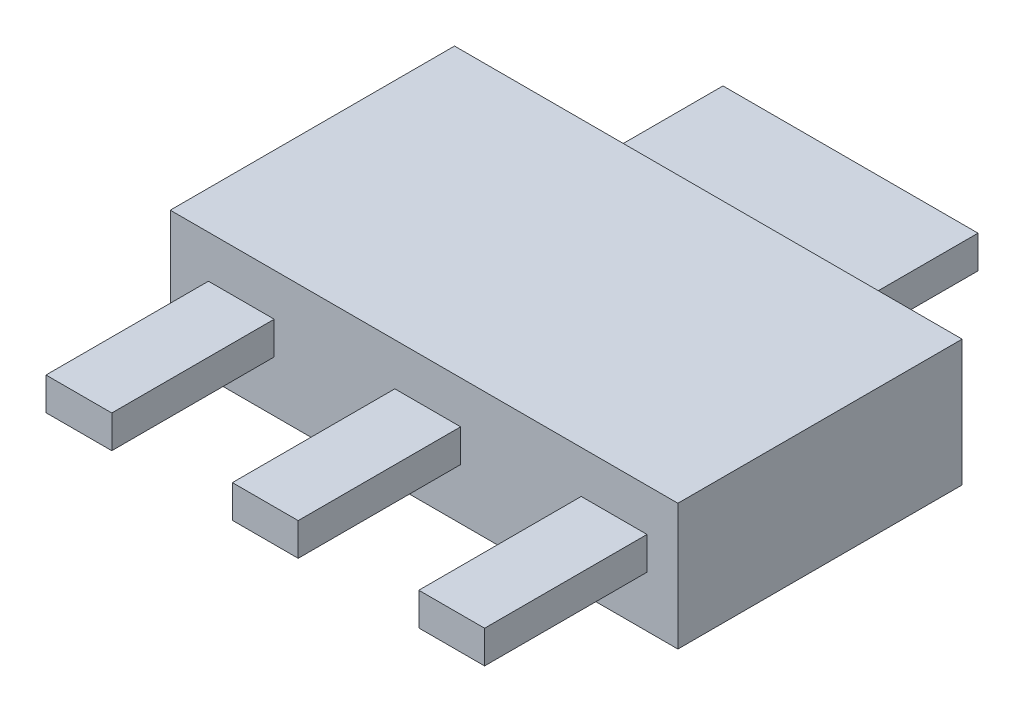
ISO-10303-21;
HEADER;
FILE_DESCRIPTION(('STEP AP214'),'2;1');
FILE_NAME('part.step','',(''),(''),'','','');
FILE_SCHEMA(('AUTOMOTIVE_DESIGN { 1 0 10303 214 1 1 1 1 }'));
ENDSEC;
DATA;
#1=APPLICATION_CONTEXT('core data for automotive mechanical design processes');
#2=APPLICATION_PROTOCOL_DEFINITION('international standard','automotive_design',2000,#1);
#3=PRODUCT_CONTEXT('',#1,'mechanical');
#4=PRODUCT('Part','Part','',(#3));
#5=PRODUCT_RELATED_PRODUCT_CATEGORY('part','',(#4));
#6=PRODUCT_DEFINITION_FORMATION('','',#4);
#7=PRODUCT_DEFINITION_CONTEXT('part definition',#1,'design');
#8=PRODUCT_DEFINITION('design','',#6,#7);
#9=PRODUCT_DEFINITION_SHAPE('','',#8);
#10=(LENGTH_UNIT() NAMED_UNIT(*) SI_UNIT(.MILLI.,.METRE.));
#11=(NAMED_UNIT(*) PLANE_ANGLE_UNIT() SI_UNIT($,.RADIAN.));
#12=(NAMED_UNIT(*) SI_UNIT($,.STERADIAN.) SOLID_ANGLE_UNIT());
#13=UNCERTAINTY_MEASURE_WITH_UNIT(LENGTH_MEASURE(1.E-05),#10,'distance_accuracy_value','');
#14=(GEOMETRIC_REPRESENTATION_CONTEXT(3) GLOBAL_UNCERTAINTY_ASSIGNED_CONTEXT((#13)) GLOBAL_UNIT_ASSIGNED_CONTEXT((#10,
#11,#12)) REPRESENTATION_CONTEXT('',''));
#15=CARTESIAN_POINT('',(0.,0.,0.));
#16=DIRECTION('',(0.,0.,1.));
#17=DIRECTION('',(1.,0.,0.));
#18=AXIS2_PLACEMENT_3D('',#15,#16,#17);
#19=CARTESIAN_POINT('',(5.06,1.0325,2.));
#20=DIRECTION('',(1.,0.,0.));
#21=DIRECTION('',(0.,0.,-1.));
#22=AXIS2_PLACEMENT_3D('',#19,#20,#21);
#23=PLANE('',#22);
#24=DIRECTION('',(0.,-1.,0.));
#25=VECTOR('',#24,1.);
#26=CARTESIAN_POINT('',(5.06,1.0325,0.));
#27=LINE('',#26,#25);
#28=CARTESIAN_POINT('',(5.06,1.0325,0.));
#29=VERTEX_POINT('',#28);
#30=CARTESIAN_POINT('',(5.06,0.63,0.));
#31=VERTEX_POINT('',#30);
#32=EDGE_CURVE('E106',#29,#31,#27,.T.);
#33=ORIENTED_EDGE('',*,*,#32,.T.);
#34=DIRECTION('',(0.,0.,-1.));
#35=VECTOR('',#34,1.);
#36=CARTESIAN_POINT('',(5.06,0.63,2.));
#37=LINE('',#36,#35);
#38=CARTESIAN_POINT('',(5.06,0.63,2.));
#39=VERTEX_POINT('',#38);
#40=EDGE_CURVE('E12',#39,#31,#37,.T.);
#41=ORIENTED_EDGE('',*,*,#40,.F.);
#42=DIRECTION('',(0.,-1.,0.));
#43=VECTOR('',#42,1.);
#44=CARTESIAN_POINT('',(5.06,1.0325,2.));
#45=LINE('',#44,#43);
#46=CARTESIAN_POINT('',(5.06,1.0325,2.));
#47=VERTEX_POINT('',#46);
#48=EDGE_CURVE('E94',#47,#39,#45,.T.);
#49=ORIENTED_EDGE('',*,*,#48,.F.);
#50=DIRECTION('',(0.,0.,-1.));
#51=VECTOR('',#50,1.);
#52=CARTESIAN_POINT('',(5.06,1.0325,2.));
#53=LINE('',#52,#51);
#54=EDGE_CURVE('E102',#47,#29,#53,.T.);
#55=ORIENTED_EDGE('',*,*,#54,.T.);
#56=EDGE_LOOP('',(#33,#41,#49,#55));
#57=FACE_BOUND('',#56,.T.);
#58=ADVANCED_FACE('F43',(#57),#23,.F.);
#59=CARTESIAN_POINT('',(5.06,0.63,2.));
#60=DIRECTION('',(0.,1.,0.));
#61=DIRECTION('',(0.,0.,1.));
#62=AXIS2_PLACEMENT_3D('',#59,#60,#61);
#63=PLANE('',#62);
#64=DIRECTION('',(1.,0.,0.));
#65=VECTOR('',#64,1.);
#66=CARTESIAN_POINT('',(5.06,0.63,0.));
#67=LINE('',#66,#65);
#68=CARTESIAN_POINT('',(5.87,0.63,0.));
#69=VERTEX_POINT('',#68);
#70=EDGE_CURVE('E98',#31,#69,#67,.T.);
#71=ORIENTED_EDGE('',*,*,#70,.T.);
#72=DIRECTION('',(0.,0.,-1.));
#73=VECTOR('',#72,1.);
#74=CARTESIAN_POINT('',(5.87,0.63,2.));
#75=LINE('',#74,#73);
#76=CARTESIAN_POINT('',(5.87,0.63,2.));
#77=VERTEX_POINT('',#76);
#78=EDGE_CURVE('E51',#77,#69,#75,.T.);
#79=ORIENTED_EDGE('',*,*,#78,.F.);
#80=DIRECTION('',(1.,0.,0.));
#81=VECTOR('',#80,1.);
#82=CARTESIAN_POINT('',(5.06,0.63,2.));
#83=LINE('',#82,#81);
#84=EDGE_CURVE('E89',#39,#77,#83,.T.);
#85=ORIENTED_EDGE('',*,*,#84,.F.);
#86=ORIENTED_EDGE('',*,*,#40,.T.);
#87=EDGE_LOOP('',(#71,#79,#85,#86));
#88=FACE_BOUND('',#87,.T.);
#89=ADVANCED_FACE('F97',(#88),#63,.F.);
#90=CARTESIAN_POINT('',(5.87,1.0325,2.));
#91=DIRECTION('',(-1.,0.,0.));
#92=DIRECTION('',(0.,0.,1.));
#93=AXIS2_PLACEMENT_3D('',#90,#91,#92);
#94=PLANE('',#93);
#95=DIRECTION('',(0.,1.,0.));
#96=VECTOR('',#95,1.);
#97=CARTESIAN_POINT('',(5.87,1.0325,0.));
#98=LINE('',#97,#96);
#99=CARTESIAN_POINT('',(5.87,1.0325,0.));
#100=VERTEX_POINT('',#99);
#101=EDGE_CURVE('E76',#69,#100,#98,.T.);
#102=ORIENTED_EDGE('',*,*,#101,.T.);
#103=DIRECTION('',(0.,0.,-1.));
#104=VECTOR('',#103,1.);
#105=CARTESIAN_POINT('',(5.87,1.0325,2.));
#106=LINE('',#105,#104);
#107=CARTESIAN_POINT('',(5.87,1.0325,2.));
#108=VERTEX_POINT('',#107);
#109=EDGE_CURVE('E99',#108,#100,#106,.T.);
#110=ORIENTED_EDGE('',*,*,#109,.F.);
#111=DIRECTION('',(0.,1.,0.));
#112=VECTOR('',#111,1.);
#113=CARTESIAN_POINT('',(5.87,1.0325,2.));
#114=LINE('',#113,#112);
#115=EDGE_CURVE('E92',#77,#108,#114,.T.);
#116=ORIENTED_EDGE('',*,*,#115,.F.);
#117=ORIENTED_EDGE('',*,*,#78,.T.);
#118=EDGE_LOOP('',(#102,#110,#116,#117));
#119=FACE_BOUND('',#118,.T.);
#120=ADVANCED_FACE('F100',(#119),#94,.F.);
#121=CARTESIAN_POINT('',(5.06,1.0325,2.));
#122=DIRECTION('',(0.,-1.,0.));
#123=DIRECTION('',(0.,0.,-1.));
#124=AXIS2_PLACEMENT_3D('',#121,#122,#123);
#125=PLANE('',#124);
#126=DIRECTION('',(-1.,0.,0.));
#127=VECTOR('',#126,1.);
#128=CARTESIAN_POINT('',(5.06,1.0325,0.));
#129=LINE('',#128,#127);
#130=EDGE_CURVE('E82',#100,#29,#129,.T.);
#131=ORIENTED_EDGE('',*,*,#130,.T.);
#132=ORIENTED_EDGE('',*,*,#54,.F.);
#133=DIRECTION('',(-1.,0.,0.));
#134=VECTOR('',#133,1.);
#135=CARTESIAN_POINT('',(5.06,1.0325,2.));
#136=LINE('',#135,#134);
#137=EDGE_CURVE('E59',#108,#47,#136,.T.);
#138=ORIENTED_EDGE('',*,*,#137,.F.);
#139=ORIENTED_EDGE('',*,*,#109,.T.);
#140=EDGE_LOOP('',(#131,#132,#138,#139));
#141=FACE_BOUND('',#140,.T.);
#142=ADVANCED_FACE('F113',(#141),#125,.F.);
#143=CARTESIAN_POINT('',(0.,0.,2.));
#144=DIRECTION('',(0.,0.,1.));
#145=DIRECTION('',(1.,0.,0.));
#146=AXIS2_PLACEMENT_3D('',#143,#144,#145);
#147=PLANE('',#146);
#148=ORIENTED_EDGE('',*,*,#48,.T.);
#149=ORIENTED_EDGE('',*,*,#84,.T.);
#150=ORIENTED_EDGE('',*,*,#115,.T.);
#151=ORIENTED_EDGE('',*,*,#137,.T.);
#152=EDGE_LOOP('',(#148,#149,#150,#151));
#153=FACE_BOUND('',#152,.T.);
#154=ADVANCED_FACE('F90',(#153),#147,.T.);
#155=CARTESIAN_POINT('',(0.,0.,0.));
#156=DIRECTION('',(0.,0.,1.));
#157=DIRECTION('',(1.,0.,0.));
#158=AXIS2_PLACEMENT_3D('',#155,#156,#157);
#159=PLANE('',#158);
#160=ORIENTED_EDGE('',*,*,#32,.F.);
#161=ORIENTED_EDGE('',*,*,#130,.F.);
#162=ORIENTED_EDGE('',*,*,#101,.F.);
#163=ORIENTED_EDGE('',*,*,#70,.F.);
#164=EDGE_LOOP('',(#160,#161,#162,#163));
#165=FACE_BOUND('',#164,.T.);
#166=ADVANCED_FACE('F116',(#165),#159,.F.);
#167=CLOSED_SHELL('',(#58,#89,#120,#142,#154,#166));
#168=MANIFOLD_SOLID_BREP('B2',#167);
#169=CARTESIAN_POINT('',(2.765,1.0325,2.));
#170=DIRECTION('',(1.,0.,0.));
#171=DIRECTION('',(0.,0.,-1.));
#172=AXIS2_PLACEMENT_3D('',#169,#170,#171);
#173=PLANE('',#172);
#174=DIRECTION('',(0.,-1.,0.));
#175=VECTOR('',#174,1.);
#176=CARTESIAN_POINT('',(2.765,1.0325,0.));
#177=LINE('',#176,#175);
#178=CARTESIAN_POINT('',(2.765,1.0325,0.));
#179=VERTEX_POINT('',#178);
#180=CARTESIAN_POINT('',(2.765,0.63,0.));
#181=VERTEX_POINT('',#180);
#182=EDGE_CURVE('E239',#179,#181,#177,.T.);
#183=ORIENTED_EDGE('',*,*,#182,.T.);
#184=DIRECTION('',(0.,0.,-1.));
#185=VECTOR('',#184,1.);
#186=CARTESIAN_POINT('',(2.765,0.63,2.));
#187=LINE('',#186,#185);
#188=CARTESIAN_POINT('',(2.765,0.63,2.));
#189=VERTEX_POINT('',#188);
#190=EDGE_CURVE('E41',#189,#181,#187,.T.);
#191=ORIENTED_EDGE('',*,*,#190,.F.);
#192=DIRECTION('',(0.,-1.,0.));
#193=VECTOR('',#192,1.);
#194=CARTESIAN_POINT('',(2.765,1.0325,2.));
#195=LINE('',#194,#193);
#196=CARTESIAN_POINT('',(2.765,1.0325,2.));
#197=VERTEX_POINT('',#196);
#198=EDGE_CURVE('E227',#197,#189,#195,.T.);
#199=ORIENTED_EDGE('',*,*,#198,.F.);
#200=DIRECTION('',(0.,0.,-1.));
#201=VECTOR('',#200,1.);
#202=CARTESIAN_POINT('',(2.765,1.0325,2.));
#203=LINE('',#202,#201);
#204=EDGE_CURVE('E235',#197,#179,#203,.T.);
#205=ORIENTED_EDGE('',*,*,#204,.T.);
#206=EDGE_LOOP('',(#183,#191,#199,#205));
#207=FACE_BOUND('',#206,.T.);
#208=ADVANCED_FACE('F176',(#207),#173,.F.);
#209=CARTESIAN_POINT('',(2.765,0.63,2.));
#210=DIRECTION('',(0.,1.,0.));
#211=DIRECTION('',(0.,0.,1.));
#212=AXIS2_PLACEMENT_3D('',#209,#210,#211);
#213=PLANE('',#212);
#214=DIRECTION('',(1.,0.,0.));
#215=VECTOR('',#214,1.);
#216=CARTESIAN_POINT('',(2.765,0.63,0.));
#217=LINE('',#216,#215);
#218=CARTESIAN_POINT('',(3.575,0.63,0.));
#219=VERTEX_POINT('',#218);
#220=EDGE_CURVE('E231',#181,#219,#217,.T.);
#221=ORIENTED_EDGE('',*,*,#220,.T.);
#222=DIRECTION('',(0.,0.,-1.));
#223=VECTOR('',#222,1.);
#224=CARTESIAN_POINT('',(3.575,0.63,2.));
#225=LINE('',#224,#223);
#226=CARTESIAN_POINT('',(3.575,0.63,2.));
#227=VERTEX_POINT('',#226);
#228=EDGE_CURVE('E184',#227,#219,#225,.T.);
#229=ORIENTED_EDGE('',*,*,#228,.F.);
#230=DIRECTION('',(1.,0.,0.));
#231=VECTOR('',#230,1.);
#232=CARTESIAN_POINT('',(2.765,0.63,2.));
#233=LINE('',#232,#231);
#234=EDGE_CURVE('E222',#189,#227,#233,.T.);
#235=ORIENTED_EDGE('',*,*,#234,.F.);
#236=ORIENTED_EDGE('',*,*,#190,.T.);
#237=EDGE_LOOP('',(#221,#229,#235,#236));
#238=FACE_BOUND('',#237,.T.);
#239=ADVANCED_FACE('F230',(#238),#213,.F.);
#240=CARTESIAN_POINT('',(3.575,1.0325,2.));
#241=DIRECTION('',(-1.,0.,0.));
#242=DIRECTION('',(0.,0.,1.));
#243=AXIS2_PLACEMENT_3D('',#240,#241,#242);
#244=PLANE('',#243);
#245=DIRECTION('',(0.,1.,0.));
#246=VECTOR('',#245,1.);
#247=CARTESIAN_POINT('',(3.575,1.0325,0.));
#248=LINE('',#247,#246);
#249=CARTESIAN_POINT('',(3.575,1.0325,0.));
#250=VERTEX_POINT('',#249);
#251=EDGE_CURVE('E209',#219,#250,#248,.T.);
#252=ORIENTED_EDGE('',*,*,#251,.T.);
#253=DIRECTION('',(0.,0.,-1.));
#254=VECTOR('',#253,1.);
#255=CARTESIAN_POINT('',(3.575,1.0325,2.));
#256=LINE('',#255,#254);
#257=CARTESIAN_POINT('',(3.575,1.0325,2.));
#258=VERTEX_POINT('',#257);
#259=EDGE_CURVE('E232',#258,#250,#256,.T.);
#260=ORIENTED_EDGE('',*,*,#259,.F.);
#261=DIRECTION('',(0.,1.,0.));
#262=VECTOR('',#261,1.);
#263=CARTESIAN_POINT('',(3.575,1.0325,2.));
#264=LINE('',#263,#262);
#265=EDGE_CURVE('E225',#227,#258,#264,.T.);
#266=ORIENTED_EDGE('',*,*,#265,.F.);
#267=ORIENTED_EDGE('',*,*,#228,.T.);
#268=EDGE_LOOP('',(#252,#260,#266,#267));
#269=FACE_BOUND('',#268,.T.);
#270=ADVANCED_FACE('F233',(#269),#244,.F.);
#271=CARTESIAN_POINT('',(2.765,1.0325,2.));
#272=DIRECTION('',(0.,-1.,0.));
#273=DIRECTION('',(0.,0.,-1.));
#274=AXIS2_PLACEMENT_3D('',#271,#272,#273);
#275=PLANE('',#274);
#276=DIRECTION('',(-1.,0.,0.));
#277=VECTOR('',#276,1.);
#278=CARTESIAN_POINT('',(2.765,1.0325,0.));
#279=LINE('',#278,#277);
#280=EDGE_CURVE('E215',#250,#179,#279,.T.);
#281=ORIENTED_EDGE('',*,*,#280,.T.);
#282=ORIENTED_EDGE('',*,*,#204,.F.);
#283=DIRECTION('',(-1.,0.,0.));
#284=VECTOR('',#283,1.);
#285=CARTESIAN_POINT('',(2.765,1.0325,2.));
#286=LINE('',#285,#284);
#287=EDGE_CURVE('E192',#258,#197,#286,.T.);
#288=ORIENTED_EDGE('',*,*,#287,.F.);
#289=ORIENTED_EDGE('',*,*,#259,.T.);
#290=EDGE_LOOP('',(#281,#282,#288,#289));
#291=FACE_BOUND('',#290,.T.);
#292=ADVANCED_FACE('F246',(#291),#275,.F.);
#293=CARTESIAN_POINT('',(0.,0.,2.));
#294=DIRECTION('',(0.,0.,1.));
#295=DIRECTION('',(1.,0.,0.));
#296=AXIS2_PLACEMENT_3D('',#293,#294,#295);
#297=PLANE('',#296);
#298=ORIENTED_EDGE('',*,*,#198,.T.);
#299=ORIENTED_EDGE('',*,*,#234,.T.);
#300=ORIENTED_EDGE('',*,*,#265,.T.);
#301=ORIENTED_EDGE('',*,*,#287,.T.);
#302=EDGE_LOOP('',(#298,#299,#300,#301));
#303=FACE_BOUND('',#302,.T.);
#304=ADVANCED_FACE('F223',(#303),#297,.T.);
#305=CARTESIAN_POINT('',(0.,0.,0.));
#306=DIRECTION('',(0.,0.,1.));
#307=DIRECTION('',(1.,0.,0.));
#308=AXIS2_PLACEMENT_3D('',#305,#306,#307);
#309=PLANE('',#308);
#310=ORIENTED_EDGE('',*,*,#182,.F.);
#311=ORIENTED_EDGE('',*,*,#280,.F.);
#312=ORIENTED_EDGE('',*,*,#251,.F.);
#313=ORIENTED_EDGE('',*,*,#220,.F.);
#314=EDGE_LOOP('',(#310,#311,#312,#313));
#315=FACE_BOUND('',#314,.T.);
#316=ADVANCED_FACE('F249',(#315),#309,.F.);
#317=CLOSED_SHELL('',(#208,#239,#270,#292,#304,#316));
#318=MANIFOLD_SOLID_BREP('B6',#317);
#319=CARTESIAN_POINT('',(0.47,1.0325,2.));
#320=DIRECTION('',(1.,0.,0.));
#321=DIRECTION('',(0.,0.,-1.));
#322=AXIS2_PLACEMENT_3D('',#319,#320,#321);
#323=PLANE('',#322);
#324=DIRECTION('',(0.,-1.,0.));
#325=VECTOR('',#324,1.);
#326=CARTESIAN_POINT('',(0.47,1.0325,0.));
#327=LINE('',#326,#325);
#328=CARTESIAN_POINT('',(0.47,1.0325,0.));
#329=VERTEX_POINT('',#328);
#330=CARTESIAN_POINT('',(0.47,0.63,0.));
#331=VERTEX_POINT('',#330);
#332=EDGE_CURVE('E371',#329,#331,#327,.T.);
#333=ORIENTED_EDGE('',*,*,#332,.T.);
#334=DIRECTION('',(0.,0.,-1.));
#335=VECTOR('',#334,1.);
#336=CARTESIAN_POINT('',(0.47,0.63,2.));
#337=LINE('',#336,#335);
#338=CARTESIAN_POINT('',(0.47,0.63,2.));
#339=VERTEX_POINT('',#338);
#340=EDGE_CURVE('E174',#339,#331,#337,.T.);
#341=ORIENTED_EDGE('',*,*,#340,.F.);
#342=DIRECTION('',(0.,-1.,0.));
#343=VECTOR('',#342,1.);
#344=CARTESIAN_POINT('',(0.47,1.0325,2.));
#345=LINE('',#344,#343);
#346=CARTESIAN_POINT('',(0.47,1.0325,2.));
#347=VERTEX_POINT('',#346);
#348=EDGE_CURVE('E359',#347,#339,#345,.T.);
#349=ORIENTED_EDGE('',*,*,#348,.F.);
#350=DIRECTION('',(0.,0.,-1.));
#351=VECTOR('',#350,1.);
#352=CARTESIAN_POINT('',(0.47,1.0325,2.));
#353=LINE('',#352,#351);
#354=EDGE_CURVE('E367',#347,#329,#353,.T.);
#355=ORIENTED_EDGE('',*,*,#354,.T.);
#356=EDGE_LOOP('',(#333,#341,#349,#355));
#357=FACE_BOUND('',#356,.T.);
#358=ADVANCED_FACE('F308',(#357),#323,.F.);
#359=CARTESIAN_POINT('',(0.47,0.63,2.));
#360=DIRECTION('',(0.,1.,0.));
#361=DIRECTION('',(0.,0.,1.));
#362=AXIS2_PLACEMENT_3D('',#359,#360,#361);
#363=PLANE('',#362);
#364=DIRECTION('',(1.,0.,0.));
#365=VECTOR('',#364,1.);
#366=CARTESIAN_POINT('',(0.47,0.63,0.));
#367=LINE('',#366,#365);
#368=CARTESIAN_POINT('',(1.28,0.63,0.));
#369=VERTEX_POINT('',#368);
#370=EDGE_CURVE('E363',#331,#369,#367,.T.);
#371=ORIENTED_EDGE('',*,*,#370,.T.);
#372=DIRECTION('',(0.,0.,-1.));
#373=VECTOR('',#372,1.);
#374=CARTESIAN_POINT('',(1.28,0.63,2.));
#375=LINE('',#374,#373);
#376=CARTESIAN_POINT('',(1.28,0.63,2.));
#377=VERTEX_POINT('',#376);
#378=EDGE_CURVE('E316',#377,#369,#375,.T.);
#379=ORIENTED_EDGE('',*,*,#378,.F.);
#380=DIRECTION('',(1.,0.,0.));
#381=VECTOR('',#380,1.);
#382=CARTESIAN_POINT('',(0.47,0.63,2.));
#383=LINE('',#382,#381);
#384=EDGE_CURVE('E354',#339,#377,#383,.T.);
#385=ORIENTED_EDGE('',*,*,#384,.F.);
#386=ORIENTED_EDGE('',*,*,#340,.T.);
#387=EDGE_LOOP('',(#371,#379,#385,#386));
#388=FACE_BOUND('',#387,.T.);
#389=ADVANCED_FACE('F362',(#388),#363,.F.);
#390=CARTESIAN_POINT('',(1.28,1.0325,2.));
#391=DIRECTION('',(-1.,0.,0.));
#392=DIRECTION('',(0.,0.,1.));
#393=AXIS2_PLACEMENT_3D('',#390,#391,#392);
#394=PLANE('',#393);
#395=DIRECTION('',(0.,1.,0.));
#396=VECTOR('',#395,1.);
#397=CARTESIAN_POINT('',(1.28,1.0325,0.));
#398=LINE('',#397,#396);
#399=CARTESIAN_POINT('',(1.28,1.0325,0.));
#400=VERTEX_POINT('',#399);
#401=EDGE_CURVE('E341',#369,#400,#398,.T.);
#402=ORIENTED_EDGE('',*,*,#401,.T.);
#403=DIRECTION('',(0.,0.,-1.));
#404=VECTOR('',#403,1.);
#405=CARTESIAN_POINT('',(1.28,1.0325,2.));
#406=LINE('',#405,#404);
#407=CARTESIAN_POINT('',(1.28,1.0325,2.));
#408=VERTEX_POINT('',#407);
#409=EDGE_CURVE('E364',#408,#400,#406,.T.);
#410=ORIENTED_EDGE('',*,*,#409,.F.);
#411=DIRECTION('',(0.,1.,0.));
#412=VECTOR('',#411,1.);
#413=CARTESIAN_POINT('',(1.28,1.0325,2.));
#414=LINE('',#413,#412);
#415=EDGE_CURVE('E357',#377,#408,#414,.T.);
#416=ORIENTED_EDGE('',*,*,#415,.F.);
#417=ORIENTED_EDGE('',*,*,#378,.T.);
#418=EDGE_LOOP('',(#402,#410,#416,#417));
#419=FACE_BOUND('',#418,.T.);
#420=ADVANCED_FACE('F365',(#419),#394,.F.);
#421=CARTESIAN_POINT('',(0.47,1.0325,2.));
#422=DIRECTION('',(0.,-1.,0.));
#423=DIRECTION('',(0.,0.,-1.));
#424=AXIS2_PLACEMENT_3D('',#421,#422,#423);
#425=PLANE('',#424);
#426=DIRECTION('',(-1.,0.,0.));
#427=VECTOR('',#426,1.);
#428=CARTESIAN_POINT('',(0.47,1.0325,0.));
#429=LINE('',#428,#427);
#430=EDGE_CURVE('E347',#400,#329,#429,.T.);
#431=ORIENTED_EDGE('',*,*,#430,.T.);
#432=ORIENTED_EDGE('',*,*,#354,.F.);
#433=DIRECTION('',(-1.,0.,0.));
#434=VECTOR('',#433,1.);
#435=CARTESIAN_POINT('',(0.47,1.0325,2.));
#436=LINE('',#435,#434);
#437=EDGE_CURVE('E324',#408,#347,#436,.T.);
#438=ORIENTED_EDGE('',*,*,#437,.F.);
#439=ORIENTED_EDGE('',*,*,#409,.T.);
#440=EDGE_LOOP('',(#431,#432,#438,#439));
#441=FACE_BOUND('',#440,.T.);
#442=ADVANCED_FACE('F378',(#441),#425,.F.);
#443=CARTESIAN_POINT('',(0.,0.,2.));
#444=DIRECTION('',(0.,0.,1.));
#445=DIRECTION('',(1.,0.,0.));
#446=AXIS2_PLACEMENT_3D('',#443,#444,#445);
#447=PLANE('',#446);
#448=ORIENTED_EDGE('',*,*,#348,.T.);
#449=ORIENTED_EDGE('',*,*,#384,.T.);
#450=ORIENTED_EDGE('',*,*,#415,.T.);
#451=ORIENTED_EDGE('',*,*,#437,.T.);
#452=EDGE_LOOP('',(#448,#449,#450,#451));
#453=FACE_BOUND('',#452,.T.);
#454=ADVANCED_FACE('F355',(#453),#447,.T.);
#455=CARTESIAN_POINT('',(0.,0.,0.));
#456=DIRECTION('',(0.,0.,1.));
#457=DIRECTION('',(1.,0.,0.));
#458=AXIS2_PLACEMENT_3D('',#455,#456,#457);
#459=PLANE('',#458);
#460=ORIENTED_EDGE('',*,*,#332,.F.);
#461=ORIENTED_EDGE('',*,*,#430,.F.);
#462=ORIENTED_EDGE('',*,*,#401,.F.);
#463=ORIENTED_EDGE('',*,*,#370,.F.);
#464=EDGE_LOOP('',(#460,#461,#462,#463));
#465=FACE_BOUND('',#464,.T.);
#466=ADVANCED_FACE('F381',(#465),#459,.F.);
#467=CLOSED_SHELL('',(#358,#389,#420,#442,#454,#466));
#468=MANIFOLD_SOLID_BREP('B35',#467);
#469=CARTESIAN_POINT('',(0.,1.555,-3.5));
#470=DIRECTION('',(0.,0.,1.));
#471=DIRECTION('',(1.,0.,0.));
#472=AXIS2_PLACEMENT_3D('',#469,#470,#471);
#473=PLANE('',#472);
#474=DIRECTION('',(-1.,0.,0.));
#475=VECTOR('',#474,1.);
#476=CARTESIAN_POINT('',(0.,0.,-3.5));
#477=LINE('',#476,#475);
#478=CARTESIAN_POINT('',(6.25,0.,-3.5));
#479=VERTEX_POINT('',#478);
#480=CARTESIAN_POINT('',(0.,0.,-3.5));
#481=VERTEX_POINT('',#480);
#482=EDGE_CURVE('E530',#479,#481,#477,.T.);
#483=ORIENTED_EDGE('',*,*,#482,.T.);
#484=DIRECTION('',(0.,-1.,0.));
#485=VECTOR('',#484,1.);
#486=CARTESIAN_POINT('',(0.,1.555,-3.5));
#487=LINE('',#486,#485);
#488=CARTESIAN_POINT('',(0.,1.555,-3.5));
#489=VERTEX_POINT('',#488);
#490=EDGE_CURVE('E535',#489,#481,#487,.T.);
#491=ORIENTED_EDGE('',*,*,#490,.F.);
#492=DIRECTION('',(-1.,0.,0.));
#493=VECTOR('',#492,1.);
#494=CARTESIAN_POINT('',(0.,1.555,-3.5));
#495=LINE('',#494,#493);
#496=CARTESIAN_POINT('',(6.25,1.555,-3.5));
#497=VERTEX_POINT('',#496);
#498=EDGE_CURVE('E534',#497,#489,#495,.T.);
#499=ORIENTED_EDGE('',*,*,#498,.F.);
#500=DIRECTION('',(0.,-1.,0.));
#501=VECTOR('',#500,1.);
#502=CARTESIAN_POINT('',(6.25,1.555,-3.5));
#503=LINE('',#502,#501);
#504=EDGE_CURVE('E543',#497,#479,#503,.T.);
#505=ORIENTED_EDGE('',*,*,#504,.T.);
#506=EDGE_LOOP('',(#483,#491,#499,#505));
#507=FACE_BOUND('',#506,.T.);
#508=DIRECTION('',(0.,-1.,0.));
#509=VECTOR('',#508,1.);
#510=CARTESIAN_POINT('',(4.695,1.0325,-3.5));
#511=LINE('',#510,#509);
#512=CARTESIAN_POINT('',(4.695,1.0325,-3.5));
#513=VERTEX_POINT('',#512);
#514=CARTESIAN_POINT('',(4.695,0.63,-3.5));
#515=VERTEX_POINT('',#514);
#516=EDGE_CURVE('E516',#513,#515,#511,.T.);
#517=ORIENTED_EDGE('',*,*,#516,.F.);
#518=DIRECTION('',(1.,0.,0.));
#519=VECTOR('',#518,1.);
#520=CARTESIAN_POINT('',(4.695,1.0325,-3.5));
#521=LINE('',#520,#519);
#522=CARTESIAN_POINT('',(1.555,1.0325,-3.5));
#523=VERTEX_POINT('',#522);
#524=EDGE_CURVE('E513',#523,#513,#521,.T.);
#525=ORIENTED_EDGE('',*,*,#524,.F.);
#526=DIRECTION('',(0.,1.,0.));
#527=VECTOR('',#526,1.);
#528=CARTESIAN_POINT('',(1.555,1.0325,-3.5));
#529=LINE('',#528,#527);
#530=CARTESIAN_POINT('',(1.555,0.63,-3.5));
#531=VERTEX_POINT('',#530);
#532=EDGE_CURVE('E451',#531,#523,#529,.T.);
#533=ORIENTED_EDGE('',*,*,#532,.F.);
#534=DIRECTION('',(-1.,0.,0.));
#535=VECTOR('',#534,1.);
#536=CARTESIAN_POINT('',(4.695,0.63,-3.5));
#537=LINE('',#536,#535);
#538=EDGE_CURVE('E446',#515,#531,#537,.T.);
#539=ORIENTED_EDGE('',*,*,#538,.F.);
#540=EDGE_LOOP('',(#517,#525,#533,#539));
#541=FACE_BOUND('',#540,.T.);
#542=ADVANCED_FACE('F431',(#507,#541),#473,.F.);
#543=CARTESIAN_POINT('',(0.,1.555,0.));
#544=DIRECTION('',(1.,0.,0.));
#545=DIRECTION('',(0.,0.,-1.));
#546=AXIS2_PLACEMENT_3D('',#543,#544,#545);
#547=PLANE('',#546);
#548=DIRECTION('',(0.,0.,1.));
#549=VECTOR('',#548,1.);
#550=CARTESIAN_POINT('',(0.,0.,0.));
#551=LINE('',#550,#549);
#552=CARTESIAN_POINT('',(0.,0.,0.));
#553=VERTEX_POINT('',#552);
#554=EDGE_CURVE('E517',#481,#553,#551,.T.);
#555=ORIENTED_EDGE('',*,*,#554,.T.);
#556=DIRECTION('',(0.,-1.,0.));
#557=VECTOR('',#556,1.);
#558=CARTESIAN_POINT('',(0.,1.555,0.));
#559=LINE('',#558,#557);
#560=CARTESIAN_POINT('',(0.,1.555,0.));
#561=VERTEX_POINT('',#560);
#562=EDGE_CURVE('E306',#561,#553,#559,.T.);
#563=ORIENTED_EDGE('',*,*,#562,.F.);
#564=DIRECTION('',(0.,0.,1.));
#565=VECTOR('',#564,1.);
#566=CARTESIAN_POINT('',(0.,1.555,0.));
#567=LINE('',#566,#565);
#568=EDGE_CURVE('E526',#489,#561,#567,.T.);
#569=ORIENTED_EDGE('',*,*,#568,.F.);
#570=ORIENTED_EDGE('',*,*,#490,.T.);
#571=EDGE_LOOP('',(#555,#563,#569,#570));
#572=FACE_BOUND('',#571,.T.);
#573=ADVANCED_FACE('F433',(#572),#547,.F.);
#574=CARTESIAN_POINT('',(0.,1.555,0.));
#575=DIRECTION('',(0.,0.,-1.));
#576=DIRECTION('',(-1.,0.,0.));
#577=AXIS2_PLACEMENT_3D('',#574,#575,#576);
#578=PLANE('',#577);
#579=DIRECTION('',(1.,0.,0.));
#580=VECTOR('',#579,1.);
#581=CARTESIAN_POINT('',(0.,0.,0.));
#582=LINE('',#581,#580);
#583=CARTESIAN_POINT('',(6.25,0.,0.));
#584=VERTEX_POINT('',#583);
#585=EDGE_CURVE('E520',#553,#584,#582,.T.);
#586=ORIENTED_EDGE('',*,*,#585,.T.);
#587=DIRECTION('',(0.,-1.,0.));
#588=VECTOR('',#587,1.);
#589=CARTESIAN_POINT('',(6.25,1.555,0.));
#590=LINE('',#589,#588);
#591=CARTESIAN_POINT('',(6.25,1.555,0.));
#592=VERTEX_POINT('',#591);
#593=EDGE_CURVE('E439',#592,#584,#590,.T.);
#594=ORIENTED_EDGE('',*,*,#593,.F.);
#595=DIRECTION('',(1.,0.,0.));
#596=VECTOR('',#595,1.);
#597=CARTESIAN_POINT('',(0.,1.555,0.));
#598=LINE('',#597,#596);
#599=EDGE_CURVE('E529',#561,#592,#598,.T.);
#600=ORIENTED_EDGE('',*,*,#599,.F.);
#601=ORIENTED_EDGE('',*,*,#562,.T.);
#602=EDGE_LOOP('',(#586,#594,#600,#601));
#603=FACE_BOUND('',#602,.T.);
#604=ADVANCED_FACE('F565',(#603),#578,.F.);
#605=CARTESIAN_POINT('',(6.25,1.555,0.));
#606=DIRECTION('',(-1.,0.,0.));
#607=DIRECTION('',(0.,0.,1.));
#608=AXIS2_PLACEMENT_3D('',#605,#606,#607);
#609=PLANE('',#608);
#610=DIRECTION('',(0.,0.,-1.));
#611=VECTOR('',#610,1.);
#612=CARTESIAN_POINT('',(6.25,0.,0.));
#613=LINE('',#612,#611);
#614=EDGE_CURVE('E538',#584,#479,#613,.T.);
#615=ORIENTED_EDGE('',*,*,#614,.T.);
#616=ORIENTED_EDGE('',*,*,#504,.F.);
#617=DIRECTION('',(0.,0.,-1.));
#618=VECTOR('',#617,1.);
#619=CARTESIAN_POINT('',(6.25,1.555,0.));
#620=LINE('',#619,#618);
#621=EDGE_CURVE('E532',#592,#497,#620,.T.);
#622=ORIENTED_EDGE('',*,*,#621,.F.);
#623=ORIENTED_EDGE('',*,*,#593,.T.);
#624=EDGE_LOOP('',(#615,#616,#622,#623));
#625=FACE_BOUND('',#624,.T.);
#626=ADVANCED_FACE('F550',(#625),#609,.F.);
#627=CARTESIAN_POINT('',(0.,1.555,0.));
#628=DIRECTION('',(0.,-1.,0.));
#629=DIRECTION('',(0.,0.,-1.));
#630=AXIS2_PLACEMENT_3D('',#627,#628,#629);
#631=PLANE('',#630);
#632=ORIENTED_EDGE('',*,*,#568,.T.);
#633=ORIENTED_EDGE('',*,*,#599,.T.);
#634=ORIENTED_EDGE('',*,*,#621,.T.);
#635=ORIENTED_EDGE('',*,*,#498,.T.);
#636=EDGE_LOOP('',(#632,#633,#634,#635));
#637=FACE_BOUND('',#636,.T.);
#638=ADVANCED_FACE('F564',(#637),#631,.F.);
#639=CARTESIAN_POINT('',(0.,0.,0.));
#640=DIRECTION('',(0.,-1.,0.));
#641=DIRECTION('',(0.,0.,-1.));
#642=AXIS2_PLACEMENT_3D('',#639,#640,#641);
#643=PLANE('',#642);
#644=ORIENTED_EDGE('',*,*,#554,.F.);
#645=ORIENTED_EDGE('',*,*,#482,.F.);
#646=ORIENTED_EDGE('',*,*,#614,.F.);
#647=ORIENTED_EDGE('',*,*,#585,.F.);
#648=EDGE_LOOP('',(#644,#645,#646,#647));
#649=FACE_BOUND('',#648,.T.);
#650=ADVANCED_FACE('F556',(#649),#643,.T.);
#651=CARTESIAN_POINT('',(4.695,1.0325,-5.25));
#652=DIRECTION('',(-1.,0.,0.));
#653=DIRECTION('',(0.,0.,1.));
#654=AXIS2_PLACEMENT_3D('',#651,#652,#653);
#655=PLANE('',#654);
#656=ORIENTED_EDGE('',*,*,#516,.T.);
#657=DIRECTION('',(0.,0.,1.));
#658=VECTOR('',#657,1.);
#659=CARTESIAN_POINT('',(4.695,0.63,-5.25));
#660=LINE('',#659,#658);
#661=CARTESIAN_POINT('',(4.695,0.63,-5.25));
#662=VERTEX_POINT('',#661);
#663=EDGE_CURVE('E497',#662,#515,#660,.T.);
#664=ORIENTED_EDGE('',*,*,#663,.F.);
#665=DIRECTION('',(0.,-1.,0.));
#666=VECTOR('',#665,1.);
#667=CARTESIAN_POINT('',(4.695,1.0325,-5.25));
#668=LINE('',#667,#666);
#669=CARTESIAN_POINT('',(4.695,1.0325,-5.25));
#670=VERTEX_POINT('',#669);
#671=EDGE_CURVE('E504',#670,#662,#668,.T.);
#672=ORIENTED_EDGE('',*,*,#671,.F.);
#673=DIRECTION('',(0.,0.,1.));
#674=VECTOR('',#673,1.);
#675=CARTESIAN_POINT('',(4.695,1.0325,-5.25));
#676=LINE('',#675,#674);
#677=EDGE_CURVE('E658',#670,#513,#676,.T.);
#678=ORIENTED_EDGE('',*,*,#677,.T.);
#679=EDGE_LOOP('',(#656,#664,#672,#678));
#680=FACE_BOUND('',#679,.T.);
#681=ADVANCED_FACE('F515',(#680),#655,.F.);
#682=CARTESIAN_POINT('',(4.695,0.63,-5.25));
#683=DIRECTION('',(0.,1.,0.));
#684=DIRECTION('',(0.,0.,1.));
#685=AXIS2_PLACEMENT_3D('',#682,#683,#684);
#686=PLANE('',#685);
#687=ORIENTED_EDGE('',*,*,#538,.T.);
#688=DIRECTION('',(0.,0.,1.));
#689=VECTOR('',#688,1.);
#690=CARTESIAN_POINT('',(1.555,0.63,-5.25));
#691=LINE('',#690,#689);
#692=CARTESIAN_POINT('',(1.555,0.63,-5.25));
#693=VERTEX_POINT('',#692);
#694=EDGE_CURVE('E500',#693,#531,#691,.T.);
#695=ORIENTED_EDGE('',*,*,#694,.F.);
#696=DIRECTION('',(-1.,0.,0.));
#697=VECTOR('',#696,1.);
#698=CARTESIAN_POINT('',(4.695,0.63,-5.25));
#699=LINE('',#698,#697);
#700=EDGE_CURVE('E493',#662,#693,#699,.T.);
#701=ORIENTED_EDGE('',*,*,#700,.F.);
#702=ORIENTED_EDGE('',*,*,#663,.T.);
#703=EDGE_LOOP('',(#687,#695,#701,#702));
#704=FACE_BOUND('',#703,.T.);
#705=ADVANCED_FACE('F495',(#704),#686,.F.);
#706=CARTESIAN_POINT('',(1.555,1.0325,-5.25));
#707=DIRECTION('',(1.,0.,0.));
#708=DIRECTION('',(0.,1.,0.));
#709=AXIS2_PLACEMENT_3D('',#706,#707,#708);
#710=PLANE('',#709);
#711=ORIENTED_EDGE('',*,*,#532,.T.);
#712=DIRECTION('',(0.,0.,1.));
#713=VECTOR('',#712,1.);
#714=CARTESIAN_POINT('',(1.555,1.0325,-5.25));
#715=LINE('',#714,#713);
#716=CARTESIAN_POINT('',(1.555,1.0325,-5.25));
#717=VERTEX_POINT('',#716);
#718=EDGE_CURVE('E522',#717,#523,#715,.T.);
#719=ORIENTED_EDGE('',*,*,#718,.F.);
#720=DIRECTION('',(0.,1.,0.));
#721=VECTOR('',#720,1.);
#722=CARTESIAN_POINT('',(1.555,1.0325,-5.25));
#723=LINE('',#722,#721);
#724=EDGE_CURVE('E503',#693,#717,#723,.T.);
#725=ORIENTED_EDGE('',*,*,#724,.F.);
#726=ORIENTED_EDGE('',*,*,#694,.T.);
#727=EDGE_LOOP('',(#711,#719,#725,#726));
#728=FACE_BOUND('',#727,.T.);
#729=ADVANCED_FACE('F585',(#728),#710,.F.);
#730=CARTESIAN_POINT('',(4.695,1.0325,-5.25));
#731=DIRECTION('',(0.,-1.,0.));
#732=DIRECTION('',(0.,0.,-1.));
#733=AXIS2_PLACEMENT_3D('',#730,#731,#732);
#734=PLANE('',#733);
#735=ORIENTED_EDGE('',*,*,#524,.T.);
#736=ORIENTED_EDGE('',*,*,#677,.F.);
#737=DIRECTION('',(1.,0.,0.));
#738=VECTOR('',#737,1.);
#739=CARTESIAN_POINT('',(4.695,1.0325,-5.25));
#740=LINE('',#739,#738);
#741=EDGE_CURVE('E509',#717,#670,#740,.T.);
#742=ORIENTED_EDGE('',*,*,#741,.F.);
#743=ORIENTED_EDGE('',*,*,#718,.T.);
#744=EDGE_LOOP('',(#735,#736,#742,#743));
#745=FACE_BOUND('',#744,.T.);
#746=ADVANCED_FACE('F588',(#745),#734,.F.);
#747=CARTESIAN_POINT('',(0.,0.,-5.25));
#748=DIRECTION('',(0.,0.,-1.));
#749=DIRECTION('',(-1.,0.,0.));
#750=AXIS2_PLACEMENT_3D('',#747,#748,#749);
#751=PLANE('',#750);
#752=ORIENTED_EDGE('',*,*,#671,.T.);
#753=ORIENTED_EDGE('',*,*,#700,.T.);
#754=ORIENTED_EDGE('',*,*,#724,.T.);
#755=ORIENTED_EDGE('',*,*,#741,.T.);
#756=EDGE_LOOP('',(#752,#753,#754,#755));
#757=FACE_BOUND('',#756,.T.);
#758=ADVANCED_FACE('F507',(#757),#751,.T.);
#759=CLOSED_SHELL('',(#542,#573,#604,#626,#638,#650,#681,#705,#729,#746,#758));
#760=MANIFOLD_SOLID_BREP('B168',#759);
#761=ADVANCED_BREP_SHAPE_REPRESENTATION('',(#18,#168,#318,#468,#760),#14);
#762=SHAPE_DEFINITION_REPRESENTATION(#9,#761);
ENDSEC;
END-ISO-10303-21;
